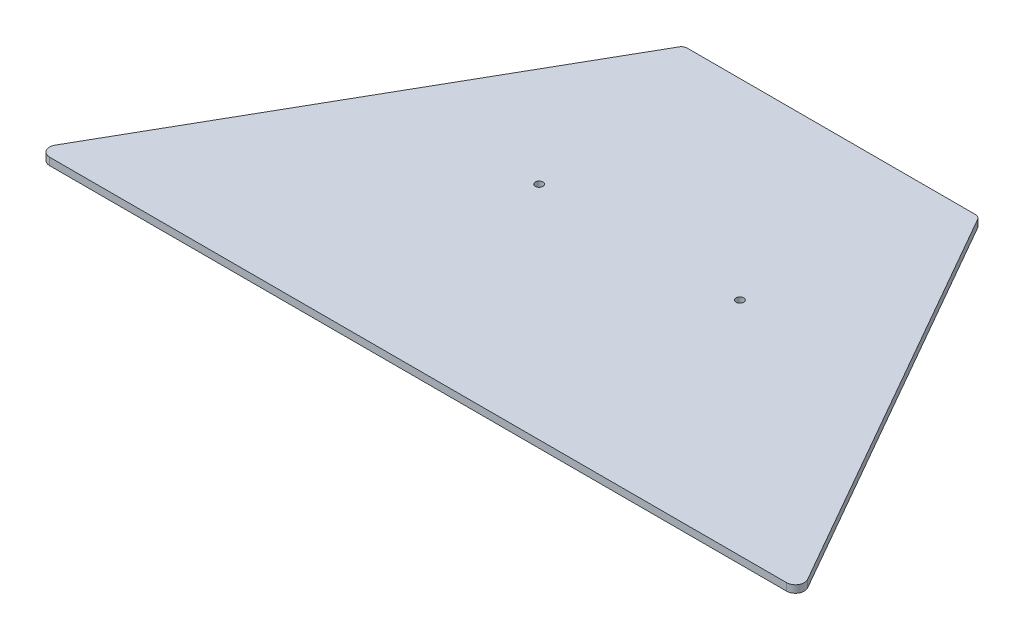
ISO-10303-21;
HEADER;
FILE_DESCRIPTION(('STEP AP214'),'2;1');
FILE_NAME('part.step','',(''),(''),'','','');
FILE_SCHEMA(('AUTOMOTIVE_DESIGN { 1 0 10303 214 1 1 1 1 }'));
ENDSEC;
DATA;
#1=APPLICATION_CONTEXT('core data for automotive mechanical design processes');
#2=APPLICATION_PROTOCOL_DEFINITION('international standard','automotive_design',2000,#1);
#3=PRODUCT_CONTEXT('',#1,'mechanical');
#4=PRODUCT('Part','Part','',(#3));
#5=PRODUCT_RELATED_PRODUCT_CATEGORY('part','',(#4));
#6=PRODUCT_DEFINITION_FORMATION('','',#4);
#7=PRODUCT_DEFINITION_CONTEXT('part definition',#1,'design');
#8=PRODUCT_DEFINITION('design','',#6,#7);
#9=PRODUCT_DEFINITION_SHAPE('','',#8);
#10=(LENGTH_UNIT() NAMED_UNIT(*) SI_UNIT(.MILLI.,.METRE.));
#11=(NAMED_UNIT(*) PLANE_ANGLE_UNIT() SI_UNIT($,.RADIAN.));
#12=(NAMED_UNIT(*) SI_UNIT($,.STERADIAN.) SOLID_ANGLE_UNIT());
#13=UNCERTAINTY_MEASURE_WITH_UNIT(LENGTH_MEASURE(1.E-05),#10,'distance_accuracy_value','');
#14=(GEOMETRIC_REPRESENTATION_CONTEXT(3) GLOBAL_UNCERTAINTY_ASSIGNED_CONTEXT((#13)) GLOBAL_UNIT_ASSIGNED_CONTEXT((#10,
#11,#12)) REPRESENTATION_CONTEXT('',''));
#15=CARTESIAN_POINT('',(0.,0.,0.));
#16=DIRECTION('',(0.,0.,1.));
#17=DIRECTION('',(1.,0.,0.));
#18=AXIS2_PLACEMENT_3D('',#15,#16,#17);
#19=CARTESIAN_POINT('',(0.,3.175,0.));
#20=DIRECTION('',(0.,1.,0.));
#21=DIRECTION('',(0.,0.,1.));
#22=AXIS2_PLACEMENT_3D('',#19,#20,#21);
#23=PLANE('',#22);
#24=DIRECTION('',(-0.496138938356834,0.,-0.868243142124459));
#25=VECTOR('',#24,1.);
#26=CARTESIAN_POINT('',(165.1,3.175,0.));
#27=LINE('',#26,#25);
#28=CARTESIAN_POINT('',(161.842691797063,3.175,-5.70028935513954));
#29=VERTEX_POINT('',#28);
#30=CARTESIAN_POINT('',(64.2313183408992,3.175,-176.520192903426));
#31=VERTEX_POINT('',#30);
#32=EDGE_CURVE('E117',#29,#31,#27,.T.);
#33=ORIENTED_EDGE('',*,*,#32,.T.);
#34=CARTESIAN_POINT('',(62.0259807599031,3.175,-175.26));
#35=DIRECTION('',(0.,1.,0.));
#36=DIRECTION('',(0.,0.,1.));
#37=AXIS2_PLACEMENT_3D('',#34,#35,#36);
#38=CIRCLE('',#37,2.54);
#39=CARTESIAN_POINT('',(62.0259807599031,3.175,-177.8));
#40=VERTEX_POINT('',#39);
#41=EDGE_CURVE('E41',#31,#40,#38,.T.);
#42=ORIENTED_EDGE('',*,*,#41,.T.);
#43=DIRECTION('',(-1.,0.,0.));
#44=VECTOR('',#43,1.);
#45=CARTESIAN_POINT('',(0.,3.175,-177.8));
#46=LINE('',#45,#44);
#47=CARTESIAN_POINT('',(-62.0259807599031,3.175,-177.8));
#48=VERTEX_POINT('',#47);
#49=EDGE_CURVE('E118',#40,#48,#46,.T.);
#50=ORIENTED_EDGE('',*,*,#49,.T.);
#51=CARTESIAN_POINT('',(-62.0259807599031,3.175,-175.26));
#52=DIRECTION('',(0.,1.,0.));
#53=DIRECTION('',(0.,0.,1.));
#54=AXIS2_PLACEMENT_3D('',#51,#52,#53);
#55=CIRCLE('',#54,2.54);
#56=CARTESIAN_POINT('',(-64.2313183408992,3.175,-176.520192903426));
#57=VERTEX_POINT('',#56);
#58=EDGE_CURVE('E48',#48,#57,#55,.T.);
#59=ORIENTED_EDGE('',*,*,#58,.T.);
#60=DIRECTION('',(0.496138938356834,0.,-0.868243142124459));
#61=VECTOR('',#60,1.);
#62=CARTESIAN_POINT('',(-165.1,3.175,0.));
#63=LINE('',#62,#61);
#64=CARTESIAN_POINT('',(-161.842691797063,3.175,-5.70028935513954));
#65=VERTEX_POINT('',#64);
#66=EDGE_CURVE('E130',#65,#57,#63,.T.);
#67=ORIENTED_EDGE('',*,*,#66,.F.);
#68=CARTESIAN_POINT('',(-158.534685425569,3.175,-3.81));
#69=DIRECTION('',(0.,1.,0.));
#70=DIRECTION('',(0.,0.,1.));
#71=AXIS2_PLACEMENT_3D('',#68,#69,#70);
#72=CIRCLE('',#71,3.81);
#73=CARTESIAN_POINT('',(-158.534685425569,3.175,0.));
#74=VERTEX_POINT('',#73);
#75=EDGE_CURVE('E138',#65,#74,#72,.T.);
#76=ORIENTED_EDGE('',*,*,#75,.T.);
#77=DIRECTION('',(1.,0.,0.));
#78=VECTOR('',#77,1.);
#79=CARTESIAN_POINT('',(0.,3.175,0.));
#80=LINE('',#79,#78);
#81=CARTESIAN_POINT('',(158.534685425569,3.175,0.));
#82=VERTEX_POINT('',#81);
#83=EDGE_CURVE('E128',#74,#82,#80,.T.);
#84=ORIENTED_EDGE('',*,*,#83,.T.);
#85=CARTESIAN_POINT('',(158.534685425569,3.175,-3.81));
#86=DIRECTION('',(0.,1.,0.));
#87=DIRECTION('',(0.,0.,1.));
#88=AXIS2_PLACEMENT_3D('',#85,#86,#87);
#89=CIRCLE('',#88,3.81);
#90=EDGE_CURVE('E140',#82,#29,#89,.T.);
#91=ORIENTED_EDGE('',*,*,#90,.T.);
#92=EDGE_LOOP('',(#33,#42,#50,#59,#67,#76,#84,#91));
#93=FACE_BOUND('',#92,.T.);
#94=CARTESIAN_POINT('',(43.18,3.175,-95.25));
#95=DIRECTION('',(0.,1.,0.));
#96=DIRECTION('',(0.,0.,1.));
#97=AXIS2_PLACEMENT_3D('',#94,#95,#96);
#98=CIRCLE('',#97,1.651);
#99=CARTESIAN_POINT('',(43.18,3.175,-93.599));
#100=VERTEX_POINT('',#99);
#101=EDGE_CURVE('E208',#100,#100,#98,.T.);
#102=ORIENTED_EDGE('',*,*,#101,.F.);
#103=EDGE_LOOP('',(#102));
#104=FACE_BOUND('',#103,.T.);
#105=CARTESIAN_POINT('',(-43.18,3.175,-95.25));
#106=DIRECTION('',(0.,-1.,0.));
#107=DIRECTION('',(0.,0.,1.));
#108=AXIS2_PLACEMENT_3D('',#105,#106,#107);
#109=CIRCLE('',#108,1.651);
#110=CARTESIAN_POINT('',(-43.18,3.175,-93.599));
#111=VERTEX_POINT('',#110);
#112=EDGE_CURVE('E219',#111,#111,#109,.T.);
#113=ORIENTED_EDGE('',*,*,#112,.T.);
#114=EDGE_LOOP('',(#113));
#115=FACE_BOUND('',#114,.T.);
#116=ADVANCED_FACE('F33',(#93,#104,#115),#23,.T.);
#117=CARTESIAN_POINT('',(0.,0.,0.));
#118=DIRECTION('',(0.,1.,0.));
#119=DIRECTION('',(0.,0.,1.));
#120=AXIS2_PLACEMENT_3D('',#117,#118,#119);
#121=PLANE('',#120);
#122=DIRECTION('',(-1.,0.,0.));
#123=VECTOR('',#122,1.);
#124=CARTESIAN_POINT('',(0.,0.,-177.8));
#125=LINE('',#124,#123);
#126=CARTESIAN_POINT('',(62.0259807599031,0.,-177.8));
#127=VERTEX_POINT('',#126);
#128=CARTESIAN_POINT('',(-62.0259807599031,0.,-177.8));
#129=VERTEX_POINT('',#128);
#130=EDGE_CURVE('E124',#127,#129,#125,.T.);
#131=ORIENTED_EDGE('',*,*,#130,.F.);
#132=CARTESIAN_POINT('',(62.0259807599031,0.,-175.26));
#133=DIRECTION('',(0.,1.,0.));
#134=DIRECTION('',(0.,0.,1.));
#135=AXIS2_PLACEMENT_3D('',#132,#133,#134);
#136=CIRCLE('',#135,2.54);
#137=CARTESIAN_POINT('',(64.2313183408992,0.,-176.520192903426));
#138=VERTEX_POINT('',#137);
#139=EDGE_CURVE('E123',#127,#138,#136,.F.);
#140=ORIENTED_EDGE('',*,*,#139,.T.);
#141=DIRECTION('',(-0.496138938356834,0.,-0.868243142124459));
#142=VECTOR('',#141,1.);
#143=CARTESIAN_POINT('',(165.1,0.,0.));
#144=LINE('',#143,#142);
#145=CARTESIAN_POINT('',(161.842691797063,0.,-5.70028935513954));
#146=VERTEX_POINT('',#145);
#147=EDGE_CURVE('E116',#146,#138,#144,.T.);
#148=ORIENTED_EDGE('',*,*,#147,.F.);
#149=CARTESIAN_POINT('',(158.534685425569,0.,-3.81));
#150=DIRECTION('',(0.,1.,0.));
#151=DIRECTION('',(0.,0.,1.));
#152=AXIS2_PLACEMENT_3D('',#149,#150,#151);
#153=CIRCLE('',#152,3.81);
#154=CARTESIAN_POINT('',(158.534685425569,0.,0.));
#155=VERTEX_POINT('',#154);
#156=EDGE_CURVE('E102',#146,#155,#153,.F.);
#157=ORIENTED_EDGE('',*,*,#156,.T.);
#158=DIRECTION('',(1.,0.,0.));
#159=VECTOR('',#158,1.);
#160=CARTESIAN_POINT('',(0.,0.,0.));
#161=LINE('',#160,#159);
#162=CARTESIAN_POINT('',(-158.534685425569,0.,0.));
#163=VERTEX_POINT('',#162);
#164=EDGE_CURVE('E125',#163,#155,#161,.T.);
#165=ORIENTED_EDGE('',*,*,#164,.F.);
#166=CARTESIAN_POINT('',(-158.534685425569,0.,-3.81));
#167=DIRECTION('',(0.,1.,0.));
#168=DIRECTION('',(0.,0.,1.));
#169=AXIS2_PLACEMENT_3D('',#166,#167,#168);
#170=CIRCLE('',#169,3.81);
#171=CARTESIAN_POINT('',(-161.842691797063,0.,-5.70028935513954));
#172=VERTEX_POINT('',#171);
#173=EDGE_CURVE('E113',#163,#172,#170,.F.);
#174=ORIENTED_EDGE('',*,*,#173,.T.);
#175=DIRECTION('',(0.496138938356834,0.,-0.868243142124459));
#176=VECTOR('',#175,1.);
#177=CARTESIAN_POINT('',(-165.1,0.,0.));
#178=LINE('',#177,#176);
#179=CARTESIAN_POINT('',(-64.2313183408992,0.,-176.520192903426));
#180=VERTEX_POINT('',#179);
#181=EDGE_CURVE('E203',#172,#180,#178,.T.);
#182=ORIENTED_EDGE('',*,*,#181,.T.);
#183=CARTESIAN_POINT('',(-62.0259807599031,0.,-175.26));
#184=DIRECTION('',(0.,1.,0.));
#185=DIRECTION('',(0.,0.,1.));
#186=AXIS2_PLACEMENT_3D('',#183,#184,#185);
#187=CIRCLE('',#186,2.54);
#188=EDGE_CURVE('E149',#180,#129,#187,.F.);
#189=ORIENTED_EDGE('',*,*,#188,.T.);
#190=EDGE_LOOP('',(#131,#140,#148,#157,#165,#174,#182,#189));
#191=FACE_BOUND('',#190,.T.);
#192=CARTESIAN_POINT('',(43.18,0.,-95.25));
#193=DIRECTION('',(0.,1.,0.));
#194=DIRECTION('',(0.,0.,1.));
#195=AXIS2_PLACEMENT_3D('',#192,#193,#194);
#196=CIRCLE('',#195,1.651);
#197=CARTESIAN_POINT('',(43.18,0.,-93.599));
#198=VERTEX_POINT('',#197);
#199=EDGE_CURVE('E205',#198,#198,#196,.T.);
#200=ORIENTED_EDGE('',*,*,#199,.T.);
#201=EDGE_LOOP('',(#200));
#202=FACE_BOUND('',#201,.T.);
#203=CARTESIAN_POINT('',(-43.18,0.,-95.25));
#204=DIRECTION('',(0.,-1.,0.));
#205=DIRECTION('',(0.,0.,1.));
#206=AXIS2_PLACEMENT_3D('',#203,#204,#205);
#207=CIRCLE('',#206,1.651);
#208=CARTESIAN_POINT('',(-43.18,0.,-93.599));
#209=VERTEX_POINT('',#208);
#210=EDGE_CURVE('E217',#209,#209,#207,.T.);
#211=ORIENTED_EDGE('',*,*,#210,.F.);
#212=EDGE_LOOP('',(#211));
#213=FACE_BOUND('',#212,.T.);
#214=ADVANCED_FACE('F121',(#191,#202,#213),#121,.F.);
#215=CARTESIAN_POINT('',(0.,3.175,0.));
#216=DIRECTION('',(0.,0.,-1.));
#217=DIRECTION('',(-1.,0.,0.));
#218=AXIS2_PLACEMENT_3D('',#215,#216,#217);
#219=PLANE('',#218);
#220=ORIENTED_EDGE('',*,*,#164,.T.);
#221=DIRECTION('',(0.,-1.,0.));
#222=VECTOR('',#221,1.);
#223=CARTESIAN_POINT('',(158.534685425569,3.175,0.));
#224=LINE('',#223,#222);
#225=EDGE_CURVE('E107',#155,#82,#224,.F.);
#226=ORIENTED_EDGE('',*,*,#225,.T.);
#227=ORIENTED_EDGE('',*,*,#83,.F.);
#228=DIRECTION('',(0.,-1.,0.));
#229=VECTOR('',#228,1.);
#230=CARTESIAN_POINT('',(-158.534685425569,0.,0.));
#231=LINE('',#230,#229);
#232=EDGE_CURVE('E112',#74,#163,#231,.T.);
#233=ORIENTED_EDGE('',*,*,#232,.T.);
#234=EDGE_LOOP('',(#220,#226,#227,#233));
#235=FACE_BOUND('',#234,.T.);
#236=ADVANCED_FACE('F178',(#235),#219,.F.);
#237=CARTESIAN_POINT('',(165.1,3.175,0.));
#238=DIRECTION('',(-0.868243142124459,0.,0.496138938356834));
#239=DIRECTION('',(0.496138938356834,0.,0.868243142124459));
#240=AXIS2_PLACEMENT_3D('',#237,#238,#239);
#241=PLANE('',#240);
#242=ORIENTED_EDGE('',*,*,#147,.T.);
#243=DIRECTION('',(0.,-1.,0.));
#244=VECTOR('',#243,1.);
#245=CARTESIAN_POINT('',(64.2313183408992,3.175,-176.520192903426));
#246=LINE('',#245,#244);
#247=EDGE_CURVE('E56',#138,#31,#246,.F.);
#248=ORIENTED_EDGE('',*,*,#247,.T.);
#249=ORIENTED_EDGE('',*,*,#32,.F.);
#250=DIRECTION('',(0.,-1.,0.));
#251=VECTOR('',#250,1.);
#252=CARTESIAN_POINT('',(161.842691797063,3.175,-5.70028935513954));
#253=LINE('',#252,#251);
#254=EDGE_CURVE('E106',#29,#146,#253,.T.);
#255=ORIENTED_EDGE('',*,*,#254,.T.);
#256=EDGE_LOOP('',(#242,#248,#249,#255));
#257=FACE_BOUND('',#256,.T.);
#258=ADVANCED_FACE('F115',(#257),#241,.F.);
#259=CARTESIAN_POINT('',(0.,3.175,-177.8));
#260=DIRECTION('',(0.,0.,1.));
#261=DIRECTION('',(1.,0.,0.));
#262=AXIS2_PLACEMENT_3D('',#259,#260,#261);
#263=PLANE('',#262);
#264=ORIENTED_EDGE('',*,*,#49,.F.);
#265=DIRECTION('',(0.,-1.,0.));
#266=VECTOR('',#265,1.);
#267=CARTESIAN_POINT('',(62.0259807599031,3.175,-177.8));
#268=LINE('',#267,#266);
#269=EDGE_CURVE('E146',#40,#127,#268,.T.);
#270=ORIENTED_EDGE('',*,*,#269,.T.);
#271=ORIENTED_EDGE('',*,*,#130,.T.);
#272=DIRECTION('',(0.,-1.,0.));
#273=VECTOR('',#272,1.);
#274=CARTESIAN_POINT('',(-62.0259807599031,3.175,-177.8));
#275=LINE('',#274,#273);
#276=EDGE_CURVE('E144',#129,#48,#275,.F.);
#277=ORIENTED_EDGE('',*,*,#276,.T.);
#278=EDGE_LOOP('',(#264,#270,#271,#277));
#279=FACE_BOUND('',#278,.T.);
#280=ADVANCED_FACE('F159',(#279),#263,.F.);
#281=CARTESIAN_POINT('',(-165.1,3.175,0.));
#282=DIRECTION('',(-0.868243142124459,0.,-0.496138938356834));
#283=DIRECTION('',(-0.496138938356834,0.,0.868243142124459));
#284=AXIS2_PLACEMENT_3D('',#281,#282,#283);
#285=PLANE('',#284);
#286=ORIENTED_EDGE('',*,*,#66,.T.);
#287=DIRECTION('',(0.,-1.,0.));
#288=VECTOR('',#287,1.);
#289=CARTESIAN_POINT('',(-64.2313183408992,0.,-176.520192903426));
#290=LINE('',#289,#288);
#291=EDGE_CURVE('E11',#57,#180,#290,.T.);
#292=ORIENTED_EDGE('',*,*,#291,.T.);
#293=ORIENTED_EDGE('',*,*,#181,.F.);
#294=DIRECTION('',(0.,-1.,0.));
#295=VECTOR('',#294,1.);
#296=CARTESIAN_POINT('',(-161.842691797063,3.175,-5.70028935513955));
#297=LINE('',#296,#295);
#298=EDGE_CURVE('E142',#172,#65,#297,.F.);
#299=ORIENTED_EDGE('',*,*,#298,.T.);
#300=EDGE_LOOP('',(#286,#292,#293,#299));
#301=FACE_BOUND('',#300,.T.);
#302=ADVANCED_FACE('F181',(#301),#285,.T.);
#303=CARTESIAN_POINT('',(158.534685425569,3.175,-3.81));
#304=DIRECTION('',(0.,-1.,0.));
#305=DIRECTION('',(0.,0.,-1.));
#306=AXIS2_PLACEMENT_3D('',#303,#304,#305);
#307=CYLINDRICAL_SURFACE('',#306,3.81);
#308=ORIENTED_EDGE('',*,*,#90,.F.);
#309=ORIENTED_EDGE('',*,*,#225,.F.);
#310=ORIENTED_EDGE('',*,*,#156,.F.);
#311=ORIENTED_EDGE('',*,*,#254,.F.);
#312=EDGE_LOOP('',(#308,#309,#310,#311));
#313=FACE_BOUND('',#312,.T.);
#314=ADVANCED_FACE('F105',(#313),#307,.T.);
#315=CARTESIAN_POINT('',(-158.534685425569,3.175,-3.81));
#316=DIRECTION('',(0.,1.,0.));
#317=DIRECTION('',(0.,0.,1.));
#318=AXIS2_PLACEMENT_3D('',#315,#316,#317);
#319=CYLINDRICAL_SURFACE('',#318,3.81);
#320=ORIENTED_EDGE('',*,*,#75,.F.);
#321=ORIENTED_EDGE('',*,*,#298,.F.);
#322=ORIENTED_EDGE('',*,*,#173,.F.);
#323=ORIENTED_EDGE('',*,*,#232,.F.);
#324=EDGE_LOOP('',(#320,#321,#322,#323));
#325=FACE_BOUND('',#324,.T.);
#326=ADVANCED_FACE('F163',(#325),#319,.T.);
#327=CARTESIAN_POINT('',(62.0259807599031,3.175,-175.26));
#328=DIRECTION('',(0.,-1.,0.));
#329=DIRECTION('',(0.,0.,-1.));
#330=AXIS2_PLACEMENT_3D('',#327,#328,#329);
#331=CYLINDRICAL_SURFACE('',#330,2.54);
#332=ORIENTED_EDGE('',*,*,#41,.F.);
#333=ORIENTED_EDGE('',*,*,#247,.F.);
#334=ORIENTED_EDGE('',*,*,#139,.F.);
#335=ORIENTED_EDGE('',*,*,#269,.F.);
#336=EDGE_LOOP('',(#332,#333,#334,#335));
#337=FACE_BOUND('',#336,.T.);
#338=ADVANCED_FACE('F161',(#337),#331,.T.);
#339=CARTESIAN_POINT('',(-62.0259807599031,3.175,-175.26));
#340=DIRECTION('',(0.,1.,0.));
#341=DIRECTION('',(0.,0.,1.));
#342=AXIS2_PLACEMENT_3D('',#339,#340,#341);
#343=CYLINDRICAL_SURFACE('',#342,2.54);
#344=ORIENTED_EDGE('',*,*,#58,.F.);
#345=ORIENTED_EDGE('',*,*,#276,.F.);
#346=ORIENTED_EDGE('',*,*,#188,.F.);
#347=ORIENTED_EDGE('',*,*,#291,.F.);
#348=EDGE_LOOP('',(#344,#345,#346,#347));
#349=FACE_BOUND('',#348,.T.);
#350=ADVANCED_FACE('F35',(#349),#343,.T.);
#351=CARTESIAN_POINT('',(43.18,0.,-95.25));
#352=DIRECTION('',(0.,1.,0.));
#353=DIRECTION('',(0.,0.,1.));
#354=AXIS2_PLACEMENT_3D('',#351,#352,#353);
#355=CYLINDRICAL_SURFACE('',#354,1.651);
#356=ORIENTED_EDGE('',*,*,#199,.F.);
#357=EDGE_LOOP('',(#356));
#358=FACE_BOUND('',#357,.T.);
#359=ORIENTED_EDGE('',*,*,#101,.T.);
#360=EDGE_LOOP('',(#359));
#361=FACE_BOUND('',#360,.T.);
#362=ADVANCED_FACE('F168',(#358,#361),#355,.F.);
#363=CARTESIAN_POINT('',(-43.18,0.,-95.25));
#364=DIRECTION('',(0.,1.,0.));
#365=DIRECTION('',(0.,0.,1.));
#366=AXIS2_PLACEMENT_3D('',#363,#364,#365);
#367=CYLINDRICAL_SURFACE('',#366,1.651);
#368=ORIENTED_EDGE('',*,*,#210,.T.);
#369=EDGE_LOOP('',(#368));
#370=FACE_BOUND('',#369,.T.);
#371=ORIENTED_EDGE('',*,*,#112,.F.);
#372=EDGE_LOOP('',(#371));
#373=FACE_BOUND('',#372,.T.);
#374=ADVANCED_FACE('F225',(#370,#373),#367,.F.);
#375=CLOSED_SHELL('',(#116,#214,#236,#258,#280,#302,#314,#326,#338,#350,#362,#374));
#376=MANIFOLD_SOLID_BREP('B2',#375);
#377=ADVANCED_BREP_SHAPE_REPRESENTATION('',(#18,#376),#14);
#378=SHAPE_DEFINITION_REPRESENTATION(#9,#377);
ENDSEC;
END-ISO-10303-21;
